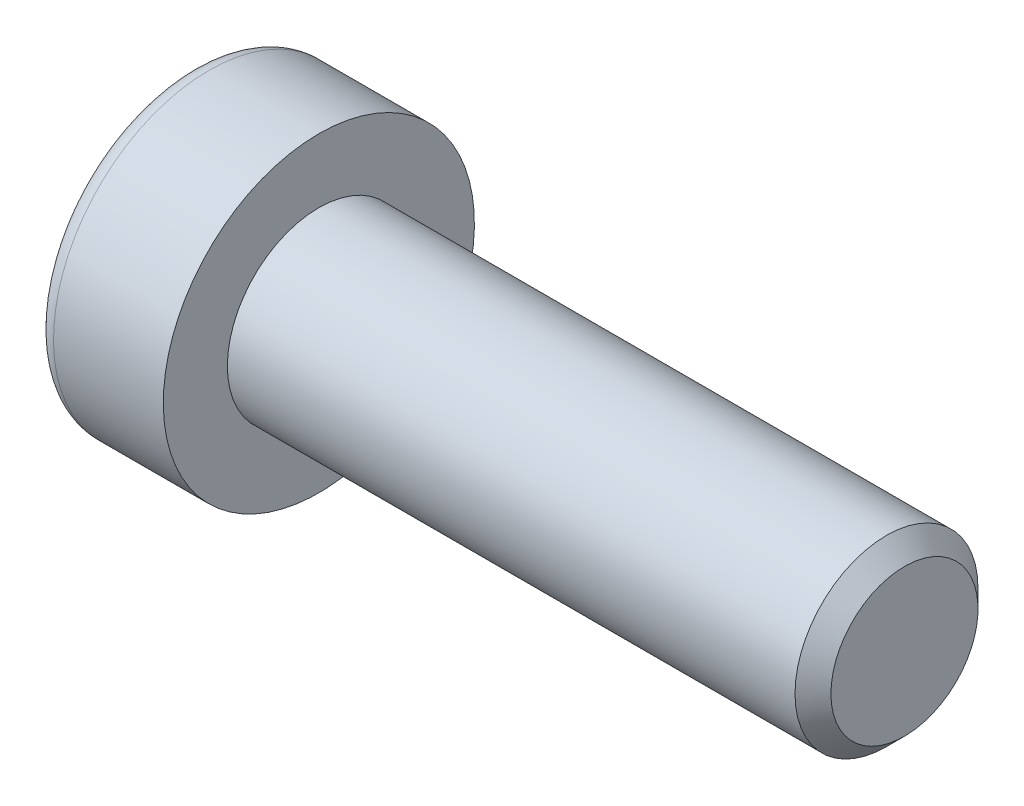
ISO-10303-21;
HEADER;
FILE_DESCRIPTION(('STEP AP214'),'2;1');
FILE_NAME('part.step','',(''),(''),'','','');
FILE_SCHEMA(('AUTOMOTIVE_DESIGN { 1 0 10303 214 1 1 1 1 }'));
ENDSEC;
DATA;
#1=APPLICATION_CONTEXT('core data for automotive mechanical design processes');
#2=APPLICATION_PROTOCOL_DEFINITION('international standard','automotive_design',2000,#1);
#3=PRODUCT_CONTEXT('',#1,'mechanical');
#4=PRODUCT('Part','Part','',(#3));
#5=PRODUCT_RELATED_PRODUCT_CATEGORY('part','',(#4));
#6=PRODUCT_DEFINITION_FORMATION('','',#4);
#7=PRODUCT_DEFINITION_CONTEXT('part definition',#1,'design');
#8=PRODUCT_DEFINITION('design','',#6,#7);
#9=PRODUCT_DEFINITION_SHAPE('','',#8);
#10=(LENGTH_UNIT() NAMED_UNIT(*) SI_UNIT(.MILLI.,.METRE.));
#11=(NAMED_UNIT(*) PLANE_ANGLE_UNIT() SI_UNIT($,.RADIAN.));
#12=(NAMED_UNIT(*) SI_UNIT($,.STERADIAN.) SOLID_ANGLE_UNIT());
#13=UNCERTAINTY_MEASURE_WITH_UNIT(LENGTH_MEASURE(1.E-05),#10,'distance_accuracy_value','');
#14=(GEOMETRIC_REPRESENTATION_CONTEXT(3) GLOBAL_UNCERTAINTY_ASSIGNED_CONTEXT((#13)) GLOBAL_UNIT_ASSIGNED_CONTEXT((#10,
#11,#12)) REPRESENTATION_CONTEXT('',''));
#15=CARTESIAN_POINT('',(0.,0.,0.));
#16=DIRECTION('',(0.,0.,1.));
#17=DIRECTION('',(1.,0.,0.));
#18=AXIS2_PLACEMENT_3D('',#15,#16,#17);
#19=CARTESIAN_POINT('',(-3.5,-1.5,0.866025403784439));
#20=DIRECTION('',(0.,-0.5,0.866025403784439));
#21=DIRECTION('',(0.,-0.866025403784439,-0.5));
#22=AXIS2_PLACEMENT_3D('',#19,#20,#21);
#23=PLANE('',#22);
#24=DIRECTION('',(1.,0.,0.));
#25=VECTOR('',#24,1.);
#26=CARTESIAN_POINT('',(-3.5,-1.5,0.866025403784438));
#27=LINE('',#26,#25);
#28=CARTESIAN_POINT('',(-0.799999988752465,-1.49999996235223,0.866025425520388));
#29=VERTEX_POINT('',#28);
#30=CARTESIAN_POINT('',(-3.5,-1.5,0.866025403784438));
#31=VERTEX_POINT('',#30);
#32=EDGE_CURVE('E77',#29,#31,#27,.F.);
#33=ORIENTED_EDGE('',*,*,#32,.T.);
#34=DIRECTION('',(0.,-0.866025403784439,-0.5));
#35=VECTOR('',#34,1.);
#36=CARTESIAN_POINT('',(-3.5,-1.5,0.866025403784439));
#37=LINE('',#36,#35);
#38=CARTESIAN_POINT('',(-3.5,0.,1.73205080756888));
#39=VERTEX_POINT('',#38);
#40=EDGE_CURVE('E89',#39,#31,#37,.T.);
#41=ORIENTED_EDGE('',*,*,#40,.F.);
#42=DIRECTION('',(1.,0.,0.));
#43=VECTOR('',#42,1.);
#44=CARTESIAN_POINT('',(-3.5,0.,1.73205080756888));
#45=LINE('',#44,#43);
#46=CARTESIAN_POINT('',(-0.799999997408769,1.16788567036042E-08,1.73205080082609));
#47=VERTEX_POINT('',#46);
#48=EDGE_CURVE('E72',#39,#47,#45,.T.);
#49=ORIENTED_EDGE('',*,*,#48,.T.);
#50=CARTESIAN_POINT('',(-0.800000004692159,-1.69050493966396E-08,1.73205077645429));
#51=CARTESIAN_POINT('',(-0.778021656597246,-0.0659159373925155,1.69399421570186));
#52=CARTESIAN_POINT('',(-0.758033502996638,-0.132400840601507,1.65560914455109));
#53=CARTESIAN_POINT('',(-0.723144784562275,-0.266521786254292,1.57817438459057));
#54=CARTESIAN_POINT('',(-0.708256560687556,-0.334160210984825,1.53912332034981));
#55=CARTESIAN_POINT('',(-0.685081966664257,-0.468598851852247,1.46150513377805));
#56=CARTESIAN_POINT('',(-0.676641338763864,-0.535378388660306,1.42294995061573));
#57=CARTESIAN_POINT('',(-0.666566875779632,-0.669251517956448,1.34565826366279));
#58=CARTESIAN_POINT('',(-0.664924696171149,-0.736344624186549,1.30692204061396));
#59=CARTESIAN_POINT('',(-0.668349719919189,-0.861700886666281,1.23454756866024));
#60=CARTESIAN_POINT('',(-0.672575966020392,-0.919982853668741,1.20089845934506));
#61=CARTESIAN_POINT('',(-0.685967975797056,-1.03616709967599,1.13381945365385));
#62=CARTESIAN_POINT('',(-0.695138309674575,-1.09406897713086,1.10038978911276));
#63=CARTESIAN_POINT('',(-0.718062369009822,-1.21049257362668,1.03317259433101));
#64=CARTESIAN_POINT('',(-0.731913222700223,-1.26899956512805,0.999393567039454));
#65=CARTESIAN_POINT('',(-0.763348804835108,-1.38514116894369,0.932339180814828));
#66=CARTESIAN_POINT('',(-0.780926151915518,-1.44277726801708,0.899062963500995));
#67=CARTESIAN_POINT('',(-0.79999997621523,-1.49999992474053,0.866025447235517));
#68=B_SPLINE_CURVE_WITH_KNOTS('',3,(#50,#51,#52,#53,#54,#55,#56,#57,#58,#59,#60,#61,#62,#63,#64,
#65,#66,#67),.UNSPECIFIED.,.F.,.F.,(4,2,2,2,2,2,2,2,4),(0.,0.237762010110539,0.476095365241995,
0.708530707813209,0.940680670771166,1.14278081103456,1.3450680891715,1.55184112927516,
1.75820836148014),.UNSPECIFIED.);
#69=EDGE_CURVE('E18',#47,#29,#68,.T.);
#70=ORIENTED_EDGE('',*,*,#69,.T.);
#71=EDGE_LOOP('',(#33,#41,#49,#70));
#72=FACE_BOUND('',#71,.T.);
#73=ADVANCED_FACE('F14',(#72),#23,.F.);
#74=CARTESIAN_POINT('',(-3.5,-1.5,-0.866025403784438));
#75=DIRECTION('',(0.,-1.,0.));
#76=DIRECTION('',(0.,0.,-1.));
#77=AXIS2_PLACEMENT_3D('',#74,#75,#76);
#78=PLANE('',#77);
#79=DIRECTION('',(1.,0.,0.));
#80=VECTOR('',#79,1.);
#81=CARTESIAN_POINT('',(-3.5,-1.5,-0.866025403784439));
#82=LINE('',#81,#80);
#83=CARTESIAN_POINT('',(-0.799999988747987,-1.5,-0.866025360297029));
#84=VERTEX_POINT('',#83);
#85=CARTESIAN_POINT('',(-3.5,-1.5,-0.866025403784438));
#86=VERTEX_POINT('',#85);
#87=EDGE_CURVE('E215',#84,#86,#82,.F.);
#88=ORIENTED_EDGE('',*,*,#87,.T.);
#89=DIRECTION('',(0.,0.,-1.));
#90=VECTOR('',#89,1.);
#91=CARTESIAN_POINT('',(-3.5,-1.5,-0.866025403784438));
#92=LINE('',#91,#90);
#93=EDGE_CURVE('E88',#31,#86,#92,.T.);
#94=ORIENTED_EDGE('',*,*,#93,.F.);
#95=ORIENTED_EDGE('',*,*,#32,.F.);
#96=CARTESIAN_POINT('',(-0.800000033339341,-1.49999996275117,0.866025430287555));
#97=CARTESIAN_POINT('',(-0.778021676206178,-1.49999998662189,0.789912288101773));
#98=CARTESIAN_POINT('',(-0.758033517853679,-1.49999999641444,0.713142136084343));
#99=CARTESIAN_POINT('',(-0.723144793791163,-1.50000000359417,0.55827260640963));
#100=CARTESIAN_POINT('',(-0.708256569043461,-1.50000000095149,0.480170477914758));
#101=CARTESIAN_POINT('',(-0.685081972467337,-1.49999999907206,0.324934102280864));
#102=CARTESIAN_POINT('',(-0.676641342887183,-1.49999999975264,0.247823733550255));
#103=CARTESIAN_POINT('',(-0.666566877072288,-1.50000000024706,0.093240355343543));
#104=CARTESIAN_POINT('',(-0.664924696315737,-1.50000000006195,0.0157679073501045));
#105=CARTESIAN_POINT('',(-0.668349718246756,-1.49999999994607,-0.128981041391079));
#106=CARTESIAN_POINT('',(-0.672575963719555,-1.49999999998546,-0.19627926292351));
#107=CARTESIAN_POINT('',(-0.685967972733245,-1.50000000001455,-0.330437280052651));
#108=CARTESIAN_POINT('',(-0.695138306475113,-1.5000000000042,-0.397296611979612));
#109=CARTESIAN_POINT('',(-0.718062365997915,-1.49999999999571,-0.531731007471154));
#110=CARTESIAN_POINT('',(-0.731913220035281,-1.49999999999786,-0.599289065134128));
#111=CARTESIAN_POINT('',(-0.763348803240228,-1.50000000000214,-0.733397843689789));
#112=CARTESIAN_POINT('',(-0.780926151044585,-1.50000000000427,-0.799950281343788));
#113=CARTESIAN_POINT('',(-0.799999976205458,-1.5,-0.866025316848431));
#114=B_SPLINE_CURVE_WITH_KNOTS('',3,(#96,#97,#98,#99,#100,#101,#102,#103,#104,#105,#106,#107,
#108,#109,#110,#111,#112,#113),.UNSPECIFIED.,.F.,.F.,(4,2,2,2,2,2,2,2,4),(0.,0.23776201743706,
0.476095379634483,0.708530728266908,0.94068069739788,1.14278084611355,1.34506813264742,
1.55184118198878,1.75820842350012),.UNSPECIFIED.);
#115=EDGE_CURVE('E82',#29,#84,#114,.T.);
#116=ORIENTED_EDGE('',*,*,#115,.T.);
#117=EDGE_LOOP('',(#88,#94,#95,#116));
#118=FACE_BOUND('',#117,.T.);
#119=ADVANCED_FACE('F86',(#118),#78,.F.);
#120=CARTESIAN_POINT('',(-3.5,0.,1.73205080756888));
#121=DIRECTION('',(0.,0.500000000000001,0.866025403784438));
#122=DIRECTION('',(0.,-0.866025403784438,0.500000000000001));
#123=AXIS2_PLACEMENT_3D('',#120,#121,#122);
#124=PLANE('',#123);
#125=ORIENTED_EDGE('',*,*,#48,.F.);
#126=DIRECTION('',(0.,-0.866025403784438,0.500000000000001));
#127=VECTOR('',#126,1.);
#128=CARTESIAN_POINT('',(-3.5,0.,1.73205080756888));
#129=LINE('',#128,#127);
#130=CARTESIAN_POINT('',(-3.5,1.5,0.866025403784437));
#131=VERTEX_POINT('',#130);
#132=EDGE_CURVE('E218',#131,#39,#129,.T.);
#133=ORIENTED_EDGE('',*,*,#132,.F.);
#134=DIRECTION('',(1.,0.,0.));
#135=VECTOR('',#134,1.);
#136=CARTESIAN_POINT('',(-3.5,1.5,0.866025403784437));
#137=LINE('',#136,#135);
#138=CARTESIAN_POINT('',(-0.799999988752185,1.5,0.866025360311568));
#139=VERTEX_POINT('',#138);
#140=EDGE_CURVE('E83',#131,#139,#137,.T.);
#141=ORIENTED_EDGE('',*,*,#140,.T.);
#142=CARTESIAN_POINT('',(-0.800000033340267,1.50000000432924,0.866025358273002));
#143=CARTESIAN_POINT('',(-0.77802167620153,1.434084101554,0.904081950048146));
#144=CARTESIAN_POINT('',(-0.758033517844483,1.36759920453459,0.942467034546998));
#145=CARTESIAN_POINT('',(-0.723144793775223,1.23347826111893,1.01990180562257));
#146=CARTESIAN_POINT('',(-0.708256569025489,1.16583983241249,1.05895286759224));
#147=CARTESIAN_POINT('',(-0.685081972455487,1.03140118657943,1.13657105378323));
#148=CARTESIAN_POINT('',(-0.676641342880228,0.964621648720204,1.17512623872849));
#149=CARTESIAN_POINT('',(-0.666566877071186,0.830748516473296,1.25241792823942));
#150=CARTESIAN_POINT('',(-0.664924696315439,0.763655408344403,1.29115415206466));
#151=CARTESIAN_POINT('',(-0.668349718361327,0.638299137352082,1.36352862873287));
#152=CARTESIAN_POINT('',(-0.672575964326027,0.580017163731366,1.39717774193718));
#153=CARTESIAN_POINT('',(-0.6859679750003,0.463832904532278,1.46425675529496));
#154=CARTESIAN_POINT('',(-0.695138309912455,0.40593102050383,1.49768642361342));
#155=CARTESIAN_POINT('',(-0.718062372353315,0.289507410577796,1.56490362613444));
#156=CARTESIAN_POINT('',(-0.73191322815959,0.23100041222722,1.5986826573841));
#157=CARTESIAN_POINT('',(-0.763348815287072,0.11485879491157,1.66573705141035));
#158=CARTESIAN_POINT('',(-0.780926165242714,0.0572226891870374,1.69901327256792));
#159=CARTESIAN_POINT('',(-0.799999992666712,2.59050251142309E-08,1.7320507926126));
#160=B_SPLINE_CURVE_WITH_KNOTS('',3,(#142,#143,#144,#145,#146,#147,#148,#149,#150,#151,#152,
#153,#154,#155,#156,#157,#158,#159),.UNSPECIFIED.,.F.,.F.,(4,2,2,2,2,2,2,2,4),(0.,
0.237762017494991,0.476095379757747,0.708530728331672,0.940680697398769,1.14278086055878,
1.34506816159042,1.55184122618243,1.7582084828283),.UNSPECIFIED.);
#161=EDGE_CURVE('E119',#139,#47,#160,.T.);
#162=ORIENTED_EDGE('',*,*,#161,.T.);
#163=EDGE_LOOP('',(#125,#133,#141,#162));
#164=FACE_BOUND('',#163,.T.);
#165=ADVANCED_FACE('F112',(#164),#124,.F.);
#166=CARTESIAN_POINT('',(-3.5,0.,-1.73205080756888));
#167=DIRECTION('',(0.,-0.5,-0.866025403784439));
#168=DIRECTION('',(0.,0.866025403784439,-0.5));
#169=AXIS2_PLACEMENT_3D('',#166,#167,#168);
#170=PLANE('',#169);
#171=DIRECTION('',(1.,0.,0.));
#172=VECTOR('',#171,1.);
#173=CARTESIAN_POINT('',(-3.5,0.,-1.73205080756888));
#174=LINE('',#173,#172);
#175=CARTESIAN_POINT('',(-0.799999993506565,-5.19317625855066E-08,-1.73205079406727));
#176=VERTEX_POINT('',#175);
#177=CARTESIAN_POINT('',(-3.5,0.,-1.73205080756888));
#178=VERTEX_POINT('',#177);
#179=EDGE_CURVE('E124',#176,#178,#174,.F.);
#180=ORIENTED_EDGE('',*,*,#179,.T.);
#181=DIRECTION('',(0.,0.866025403784439,-0.5));
#182=VECTOR('',#181,1.);
#183=CARTESIAN_POINT('',(-3.5,0.,-1.73205080756888));
#184=LINE('',#183,#182);
#185=EDGE_CURVE('E37',#86,#178,#184,.T.);
#186=ORIENTED_EDGE('',*,*,#185,.F.);
#187=ORIENTED_EDGE('',*,*,#87,.F.);
#188=CARTESIAN_POINT('',(-0.800000033344933,-1.50000000429478,-0.866025358270194));
#189=CARTESIAN_POINT('',(-0.778021676204076,-1.434084101543,-0.904081950046343));
#190=CARTESIAN_POINT('',(-0.758033517848646,-1.36759920454251,-0.942467034540241));
#191=CARTESIAN_POINT('',(-0.723144793784631,-1.23347826116319,-1.01990180559922));
#192=CARTESIAN_POINT('',(-0.70825656903836,-1.16583983247418,-1.05895286755721));
#193=CARTESIAN_POINT('',(-0.685081972464187,-1.03140118664251,-1.13657105374624));
#194=CARTESIAN_POINT('',(-0.676641342884563,-0.964621648766778,-1.17512623870145));
#195=CARTESIAN_POINT('',(-0.666566877071135,-0.830748516483595,-1.25241792823362));
#196=CARTESIAN_POINT('',(-0.664924696315527,-0.763655408334931,-1.29115415207017));
#197=CARTESIAN_POINT('',(-0.668349718248217,-0.638299141497487,-1.36352862633948));
#198=CARTESIAN_POINT('',(-0.672575963721559,-0.580017172042447,-1.39717773713877));
#199=CARTESIAN_POINT('',(-0.685967972735983,-0.463832921105549,-1.46425674572639));
#200=CARTESIAN_POINT('',(-0.695138306478038,-0.405931041173448,-1.49768641167981));
#201=CARTESIAN_POINT('',(-0.71806236600089,-0.289507439534846,-1.56490360941608));
#202=CARTESIAN_POINT('',(-0.731913220038114,-0.231000445371287,-1.59868263824837));
#203=CARTESIAN_POINT('',(-0.763348803242521,-0.114858836277305,-1.66573702752784));
#204=CARTESIAN_POINT('',(-0.780926151046482,-0.0572227345879746,-1.69901324635568));
#205=CARTESIAN_POINT('',(-0.799999976206864,-7.5284573251733E-08,-1.73205076410331));
#206=B_SPLINE_CURVE_WITH_KNOTS('',3,(#188,#189,#190,#191,#192,#193,#194,#195,#196,#197,#198,
#199,#200,#201,#202,#203,#204,#205),.UNSPECIFIED.,.F.,.F.,(4,2,2,2,2,2,2,2,4),(0.,
0.237762017439055,0.476095379638039,0.708530728271478,0.94068069740364,1.14278084611305,
1.34506813264055,1.5518411819756,1.75820842348081),.UNSPECIFIED.);
#207=EDGE_CURVE('E95',#84,#176,#206,.T.);
#208=ORIENTED_EDGE('',*,*,#207,.T.);
#209=EDGE_LOOP('',(#180,#186,#187,#208));
#210=FACE_BOUND('',#209,.T.);
#211=ADVANCED_FACE('F115',(#210),#170,.F.);
#212=CARTESIAN_POINT('',(-3.5,1.5,0.866025403784437));
#213=DIRECTION('',(0.,1.,0.));
#214=DIRECTION('',(0.,0.,1.));
#215=AXIS2_PLACEMENT_3D('',#212,#213,#214);
#216=PLANE('',#215);
#217=ORIENTED_EDGE('',*,*,#140,.F.);
#218=DIRECTION('',(0.,0.,1.));
#219=VECTOR('',#218,1.);
#220=CARTESIAN_POINT('',(-3.5,1.5,0.866025403784437));
#221=LINE('',#220,#219);
#222=CARTESIAN_POINT('',(-3.5,1.5,-0.866025403784439));
#223=VERTEX_POINT('',#222);
#224=EDGE_CURVE('E211',#223,#131,#221,.T.);
#225=ORIENTED_EDGE('',*,*,#224,.F.);
#226=DIRECTION('',(1.,0.,0.));
#227=VECTOR('',#226,1.);
#228=CARTESIAN_POINT('',(-3.5,1.5,-0.866025403784439));
#229=LINE('',#228,#227);
#230=CARTESIAN_POINT('',(-0.800000001252376,1.5,-0.866025403613502));
#231=VERTEX_POINT('',#230);
#232=EDGE_CURVE('E202',#223,#231,#229,.T.);
#233=ORIENTED_EDGE('',*,*,#232,.T.);
#234=CARTESIAN_POINT('',(-0.800000001055522,1.50000000024408,-0.866025403485148));
#235=CARTESIAN_POINT('',(-0.778021659946295,1.50000000008766,-0.789912260174054));
#236=CARTESIAN_POINT('',(-0.758033508920135,1.5000000000235,-0.713142109303839));
#237=CARTESIAN_POINT('',(-0.723144791594795,1.49999999997645,-0.558272583762016));
#238=CARTESIAN_POINT('',(-0.708256566253975,1.49999999999377,-0.480170458254432));
#239=CARTESIAN_POINT('',(-0.685081970143121,1.50000000000608,-0.324934087668005));
#240=CARTESIAN_POINT('',(-0.676641341612019,1.50000000000162,-0.247823721003289));
#241=CARTESIAN_POINT('',(-0.666566876998688,1.49999999999838,-0.0932403472124713));
#242=CARTESIAN_POINT('',(-0.664924696387335,1.4999999999996,-0.0157679015693669));
#243=CARTESIAN_POINT('',(-0.668349718380969,1.50000000000035,0.12898104465566));
#244=CARTESIAN_POINT('',(-0.67257596394769,1.5000000000001,0.196279266013383));
#245=CARTESIAN_POINT('',(-0.685967973091948,1.49999999999991,0.330437282840503));
#246=CARTESIAN_POINT('',(-0.695138306874661,1.49999999999997,0.397296614639709));
#247=CARTESIAN_POINT('',(-0.718062366419441,1.50000000000003,0.531731009618471));
#248=CARTESIAN_POINT('',(-0.731913220420444,1.50000000000002,0.599289066899477));
#249=CARTESIAN_POINT('',(-0.763348803486868,1.49999999999999,0.733397844619991));
#250=CARTESIAN_POINT('',(-0.780926151184613,1.49999999999997,0.79995028182185));
#251=CARTESIAN_POINT('',(-0.799999976214698,1.5,0.866025316880437));
#252=B_SPLINE_CURVE_WITH_KNOTS('',3,(#234,#235,#236,#237,#238,#239,#240,#241,#242,#243,#244,
#245,#246,#247,#248,#249,#250,#251),.UNSPECIFIED.,.F.,.F.,(4,2,2,2,2,2,2,2,4),(0.,
0.237762008628934,0.476095362690113,0.708530704654326,0.940680666837088,1.14278081502499,
1.34506810120493,1.55184114940234,1.75820838952185),.UNSPECIFIED.);
#253=EDGE_CURVE('E96',#231,#139,#252,.T.);
#254=ORIENTED_EDGE('',*,*,#253,.T.);
#255=EDGE_LOOP('',(#217,#225,#233,#254));
#256=FACE_BOUND('',#255,.T.);
#257=ADVANCED_FACE('F134',(#256),#216,.F.);
#258=CARTESIAN_POINT('',(-0.806000000977747,0.,0.));
#259=DIRECTION('',(-1.,0.,0.));
#260=DIRECTION('',(0.,0.,1.));
#261=AXIS2_PLACEMENT_3D('',#258,#259,#260);
#262=CONICAL_SURFACE('',#261,1.74244311182292,1.04719754993706);
#263=CARTESIAN_POINT('',(0.200000001484568,0.,0.));
#264=VERTEX_POINT('',#263);
#265=VERTEX_LOOP('',#264);
#266=FACE_BOUND('',#265,.T.);
#267=ORIENTED_EDGE('',*,*,#253,.F.);
#268=CARTESIAN_POINT('',(-0.80000000105552,1.49999999986285,-0.866025404145468));
#269=CARTESIAN_POINT('',(-0.778021659935738,1.43408408408328,-0.904081975684063));
#270=CARTESIAN_POINT('',(-0.758033508900798,1.36759918311276,-0.94246705108234));
#271=CARTESIAN_POINT('',(-0.723144791562348,1.23347823962798,-1.01990181385292));
#272=CARTESIAN_POINT('',(-0.708256566217525,1.1658398148199,-1.05895287664342));
#273=CARTESIAN_POINT('',(-0.685081970119068,1.03140117430125,-1.13657106195057));
#274=CARTESIAN_POINT('',(-0.676641341597855,0.964621637905061,-1.17512624526012));
#275=CARTESIAN_POINT('',(-0.666566876996403,0.830748509269456,-1.25241793211141));
#276=CARTESIAN_POINT('',(-0.664924696386731,0.763655403288597,-1.29115415491162));
#277=CARTESIAN_POINT('',(-0.668349718610002,0.638299130388391,-1.36352863281604));
#278=CARTESIAN_POINT('',(-0.672575965159632,0.580017152743388,-1.39717774829799));
#279=CARTESIAN_POINT('',(-0.685967977621957,0.463832885548755,-1.46425676623819));
#280=CARTESIAN_POINT('',(-0.695138313743034,0.405930997549616,-1.49768643686116));
#281=CARTESIAN_POINT('',(-0.718062379118383,0.289507379804264,-1.56490364390653));
#282=CARTESIAN_POINT('',(-0.731913236653826,0.231000377606332,-1.59868267737497));
#283=CARTESIAN_POINT('',(-0.763348827557812,0.114858752809629,-1.66573707571544));
#284=CARTESIAN_POINT('',(-0.780926179554001,0.0572226434499497,-1.69901329896927));
#285=CARTESIAN_POINT('',(-0.800000009105988,-2.341280234267E-08,-1.73205082108626));
#286=B_SPLINE_CURVE_WITH_KNOTS('',3,(#268,#269,#270,#271,#272,#273,#274,#275,#276,#277,#278,
#279,#280,#281,#282,#283,#284,#285),.UNSPECIFIED.,.F.,.F.,(4,2,2,2,2,2,2,2,4),(0.,
0.237762008744213,0.476095362935475,0.708530704782408,0.940680666837143,1.14278084388578,
1.34506815903323,1.55184123770242,1.75820850806168),.UNSPECIFIED.);
#287=EDGE_CURVE('E125',#231,#176,#286,.T.);
#288=ORIENTED_EDGE('',*,*,#287,.T.);
#289=ORIENTED_EDGE('',*,*,#207,.F.);
#290=ORIENTED_EDGE('',*,*,#115,.F.);
#291=ORIENTED_EDGE('',*,*,#69,.F.);
#292=ORIENTED_EDGE('',*,*,#161,.F.);
#293=EDGE_LOOP('',(#267,#288,#289,#290,#291,#292));
#294=FACE_BOUND('',#293,.T.);
#295=ADVANCED_FACE('F93',(#266,#294),#262,.F.);
#296=CARTESIAN_POINT('',(-3.5,1.5,-0.866025403784439));
#297=DIRECTION('',(0.,0.5,-0.866025403784439));
#298=DIRECTION('',(0.,0.866025403784439,0.5));
#299=AXIS2_PLACEMENT_3D('',#296,#297,#298);
#300=PLANE('',#299);
#301=ORIENTED_EDGE('',*,*,#232,.F.);
#302=DIRECTION('',(0.,0.866025403784439,0.5));
#303=VECTOR('',#302,1.);
#304=CARTESIAN_POINT('',(-3.5,0.,-1.73205080756888));
#305=LINE('',#304,#303);
#306=EDGE_CURVE('E213',#178,#223,#305,.T.);
#307=ORIENTED_EDGE('',*,*,#306,.F.);
#308=ORIENTED_EDGE('',*,*,#179,.F.);
#309=ORIENTED_EDGE('',*,*,#287,.F.);
#310=EDGE_LOOP('',(#301,#307,#308,#309));
#311=FACE_BOUND('',#310,.T.);
#312=ADVANCED_FACE('F143',(#311),#300,.F.);
#313=CARTESIAN_POINT('',(-3.5,2.99102540378444,0.));
#314=DIRECTION('',(-1.,0.,0.));
#315=DIRECTION('',(0.,0.,1.));
#316=AXIS2_PLACEMENT_3D('',#313,#314,#315);
#317=PLANE('',#316);
#318=ORIENTED_EDGE('',*,*,#185,.T.);
#319=ORIENTED_EDGE('',*,*,#306,.T.);
#320=ORIENTED_EDGE('',*,*,#224,.T.);
#321=ORIENTED_EDGE('',*,*,#132,.T.);
#322=ORIENTED_EDGE('',*,*,#40,.T.);
#323=ORIENTED_EDGE('',*,*,#93,.T.);
#324=EDGE_LOOP('',(#318,#319,#320,#321,#322,#323));
#325=FACE_BOUND('',#324,.T.);
#326=CARTESIAN_POINT('',(-3.5,0.,0.));
#327=DIRECTION('',(1.,0.,0.));
#328=DIRECTION('',(0.,1.,0.));
#329=AXIS2_PLACEMENT_3D('',#326,#327,#328);
#330=CIRCLE('',#329,3.75);
#331=CARTESIAN_POINT('',(-3.5,3.75,0.));
#332=VERTEX_POINT('',#331);
#333=EDGE_CURVE('E189',#332,#332,#330,.T.);
#334=ORIENTED_EDGE('',*,*,#333,.F.);
#335=EDGE_LOOP('',(#334));
#336=FACE_BOUND('',#335,.T.);
#337=ADVANCED_FACE('F176',(#325,#336),#317,.T.);
#338=CARTESIAN_POINT('',(-3.,0.,0.));
#339=DIRECTION('',(1.,0.,0.));
#340=DIRECTION('',(0.,0.,-1.));
#341=AXIS2_PLACEMENT_3D('',#338,#339,#340);
#342=TOROIDAL_SURFACE('',#341,3.75,0.5);
#343=CARTESIAN_POINT('',(-3.,0.,0.));
#344=DIRECTION('',(1.,0.,0.));
#345=DIRECTION('',(0.,1.,0.));
#346=AXIS2_PLACEMENT_3D('',#343,#344,#345);
#347=CIRCLE('',#346,4.25);
#348=CARTESIAN_POINT('',(-3.,4.25,0.));
#349=VERTEX_POINT('',#348);
#350=EDGE_CURVE('E229',#349,#349,#347,.T.);
#351=ORIENTED_EDGE('',*,*,#350,.F.);
#352=EDGE_LOOP('',(#351));
#353=FACE_BOUND('',#352,.T.);
#354=ORIENTED_EDGE('',*,*,#333,.T.);
#355=EDGE_LOOP('',(#354));
#356=FACE_BOUND('',#355,.T.);
#357=ADVANCED_FACE('F170',(#353,#356),#342,.T.);
#358=CARTESIAN_POINT('',(-1.75,0.,0.));
#359=DIRECTION('',(1.,0.,0.));
#360=DIRECTION('',(0.,1.,0.));
#361=AXIS2_PLACEMENT_3D('',#358,#359,#360);
#362=CYLINDRICAL_SURFACE('',#361,4.25);
#363=ORIENTED_EDGE('',*,*,#350,.T.);
#364=EDGE_LOOP('',(#363));
#365=FACE_BOUND('',#364,.T.);
#366=CARTESIAN_POINT('',(0.,0.,0.));
#367=DIRECTION('',(1.,0.,0.));
#368=DIRECTION('',(0.,1.,0.));
#369=AXIS2_PLACEMENT_3D('',#366,#367,#368);
#370=CIRCLE('',#369,4.25);
#371=CARTESIAN_POINT('',(0.,4.25,0.));
#372=VERTEX_POINT('',#371);
#373=EDGE_CURVE('E227',#372,#372,#370,.T.);
#374=ORIENTED_EDGE('',*,*,#373,.F.);
#375=EDGE_LOOP('',(#374));
#376=FACE_BOUND('',#375,.T.);
#377=ADVANCED_FACE('F166',(#365,#376),#362,.T.);
#378=CARTESIAN_POINT('',(16.,1.25,0.));
#379=DIRECTION('',(1.,0.,0.));
#380=DIRECTION('',(0.,0.,-1.));
#381=AXIS2_PLACEMENT_3D('',#378,#379,#380);
#382=PLANE('',#381);
#383=CARTESIAN_POINT('',(16.0000000001901,0.,0.));
#384=DIRECTION('',(-1.,0.,0.));
#385=DIRECTION('',(0.,0.,1.));
#386=AXIS2_PLACEMENT_3D('',#383,#384,#385);
#387=CIRCLE('',#386,2.00924000017721);
#388=CARTESIAN_POINT('',(16.0000000001901,0.,2.00924000017721));
#389=VERTEX_POINT('',#388);
#390=EDGE_CURVE('E225',#389,#389,#387,.T.);
#391=ORIENTED_EDGE('',*,*,#390,.F.);
#392=EDGE_LOOP('',(#391));
#393=FACE_BOUND('',#392,.T.);
#394=ADVANCED_FACE('F162',(#393),#382,.T.);
#395=CARTESIAN_POINT('',(0.,3.375,0.));
#396=DIRECTION('',(1.,0.,0.));
#397=DIRECTION('',(0.,0.,-1.));
#398=AXIS2_PLACEMENT_3D('',#395,#396,#397);
#399=PLANE('',#398);
#400=CARTESIAN_POINT('',(0.,0.,0.));
#401=DIRECTION('',(1.,0.,0.));
#402=DIRECTION('',(0.,1.,0.));
#403=AXIS2_PLACEMENT_3D('',#400,#401,#402);
#404=CIRCLE('',#403,2.5);
#405=CARTESIAN_POINT('',(0.,2.5,0.));
#406=VERTEX_POINT('',#405);
#407=EDGE_CURVE('E28',#406,#406,#404,.T.);
#408=ORIENTED_EDGE('',*,*,#407,.F.);
#409=EDGE_LOOP('',(#408));
#410=FACE_BOUND('',#409,.T.);
#411=ORIENTED_EDGE('',*,*,#373,.T.);
#412=EDGE_LOOP('',(#411));
#413=FACE_BOUND('',#412,.T.);
#414=ADVANCED_FACE('F155',(#410,#413),#399,.T.);
#415=CARTESIAN_POINT('',(15.509239999858,0.,0.));
#416=DIRECTION('',(-1.,0.,0.));
#417=DIRECTION('',(0.,0.,1.));
#418=AXIS2_PLACEMENT_3D('',#415,#416,#417);
#419=CONICAL_SURFACE('',#418,2.49999999959982,0.78539816247083);
#420=ORIENTED_EDGE('',*,*,#390,.T.);
#421=EDGE_LOOP('',(#420));
#422=FACE_BOUND('',#421,.T.);
#423=CARTESIAN_POINT('',(15.50924,0.,0.));
#424=DIRECTION('',(1.,0.,0.));
#425=DIRECTION('',(0.,1.,0.));
#426=AXIS2_PLACEMENT_3D('',#423,#424,#425);
#427=CIRCLE('',#426,2.5);
#428=CARTESIAN_POINT('',(15.50924,2.5,0.));
#429=VERTEX_POINT('',#428);
#430=EDGE_CURVE('E9',#429,#429,#427,.F.);
#431=ORIENTED_EDGE('',*,*,#430,.F.);
#432=EDGE_LOOP('',(#431));
#433=FACE_BOUND('',#432,.T.);
#434=ADVANCED_FACE('F149',(#422,#433),#419,.T.);
#435=CARTESIAN_POINT('',(9.2,0.,0.));
#436=DIRECTION('',(1.,0.,0.));
#437=DIRECTION('',(0.,1.,0.));
#438=AXIS2_PLACEMENT_3D('',#435,#436,#437);
#439=CYLINDRICAL_SURFACE('',#438,2.5);
#440=ORIENTED_EDGE('',*,*,#430,.T.);
#441=EDGE_LOOP('',(#440));
#442=FACE_BOUND('',#441,.T.);
#443=ORIENTED_EDGE('',*,*,#407,.T.);
#444=EDGE_LOOP('',(#443));
#445=FACE_BOUND('',#444,.T.);
#446=ADVANCED_FACE('F147',(#442,#445),#439,.T.);
#447=CLOSED_SHELL('',(#73,#119,#165,#211,#257,#295,#312,#337,#357,#377,#394,#414,#434,#446));
#448=MANIFOLD_SOLID_BREP('B1',#447);
#449=ADVANCED_BREP_SHAPE_REPRESENTATION('',(#18,#448),#14);
#450=SHAPE_DEFINITION_REPRESENTATION(#9,#449);
ENDSEC;
END-ISO-10303-21;
